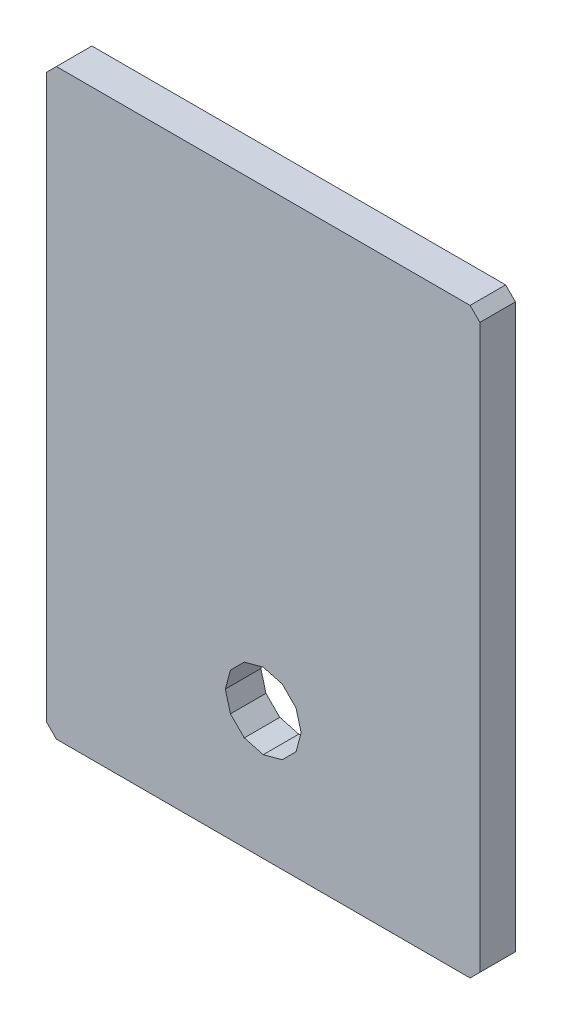
ISO-10303-21;
HEADER;
FILE_DESCRIPTION(('STEP AP214'),'2;1');
FILE_NAME('part.step','',(''),(''),'','','');
FILE_SCHEMA(('AUTOMOTIVE_DESIGN { 1 0 10303 214 1 1 1 1 }'));
ENDSEC;
DATA;
#1=APPLICATION_CONTEXT('core data for automotive mechanical design processes');
#2=APPLICATION_PROTOCOL_DEFINITION('international standard','automotive_design',2000,#1);
#3=PRODUCT_CONTEXT('',#1,'mechanical');
#4=PRODUCT('Part','Part','',(#3));
#5=PRODUCT_RELATED_PRODUCT_CATEGORY('part','',(#4));
#6=PRODUCT_DEFINITION_FORMATION('','',#4);
#7=PRODUCT_DEFINITION_CONTEXT('part definition',#1,'design');
#8=PRODUCT_DEFINITION('design','',#6,#7);
#9=PRODUCT_DEFINITION_SHAPE('','',#8);
#10=(LENGTH_UNIT() NAMED_UNIT(*) SI_UNIT(.MILLI.,.METRE.));
#11=(NAMED_UNIT(*) PLANE_ANGLE_UNIT() SI_UNIT($,.RADIAN.));
#12=(NAMED_UNIT(*) SI_UNIT($,.STERADIAN.) SOLID_ANGLE_UNIT());
#13=UNCERTAINTY_MEASURE_WITH_UNIT(LENGTH_MEASURE(1.E-05),#10,'distance_accuracy_value','');
#14=(GEOMETRIC_REPRESENTATION_CONTEXT(3) GLOBAL_UNCERTAINTY_ASSIGNED_CONTEXT((#13)) GLOBAL_UNIT_ASSIGNED_CONTEXT((#10,
#11,#12)) REPRESENTATION_CONTEXT('',''));
#15=CARTESIAN_POINT('',(0.,0.,0.));
#16=DIRECTION('',(0.,0.,1.));
#17=DIRECTION('',(1.,0.,0.));
#18=AXIS2_PLACEMENT_3D('',#15,#16,#17);
#19=CARTESIAN_POINT('',(0.,0.,1.5));
#20=DIRECTION('',(0.,0.,1.));
#21=DIRECTION('',(1.,0.,0.));
#22=AXIS2_PLACEMENT_3D('',#19,#20,#21);
#23=PLANE('',#22);
#24=DIRECTION('',(-0.70710678118655,-0.707106781186545,0.));
#25=VECTOR('',#24,1.);
#26=CARTESIAN_POINT('',(-9.15,11.8857864376269,1.5));
#27=LINE('',#26,#25);
#28=CARTESIAN_POINT('',(-8.73578643762691,12.3,1.5));
#29=VERTEX_POINT('',#28);
#30=CARTESIAN_POINT('',(-9.15,11.8857864376269,1.5));
#31=VERTEX_POINT('',#30);
#32=EDGE_CURVE('E265',#29,#31,#27,.T.);
#33=ORIENTED_EDGE('',*,*,#32,.T.);
#34=DIRECTION('',(0.,-1.,0.));
#35=VECTOR('',#34,1.);
#36=CARTESIAN_POINT('',(-9.15,11.8857864376269,1.5));
#37=LINE('',#36,#35);
#38=CARTESIAN_POINT('',(-9.15,-11.8857864376269,1.5));
#39=VERTEX_POINT('',#38);
#40=EDGE_CURVE('E268',#31,#39,#37,.T.);
#41=ORIENTED_EDGE('',*,*,#40,.T.);
#42=DIRECTION('',(0.707106781186544,-0.70710678118655,0.));
#43=VECTOR('',#42,1.);
#44=CARTESIAN_POINT('',(-8.73578643762691,-12.3,1.5));
#45=LINE('',#44,#43);
#46=CARTESIAN_POINT('',(-8.73578643762691,-12.3,1.5));
#47=VERTEX_POINT('',#46);
#48=EDGE_CURVE('E271',#39,#47,#45,.T.);
#49=ORIENTED_EDGE('',*,*,#48,.T.);
#50=DIRECTION('',(1.,0.,0.));
#51=VECTOR('',#50,1.);
#52=CARTESIAN_POINT('',(-8.73578643762691,-12.3,1.5));
#53=LINE('',#52,#51);
#54=CARTESIAN_POINT('',(8.7357864376269,-12.3,1.5));
#55=VERTEX_POINT('',#54);
#56=EDGE_CURVE('E273',#47,#55,#53,.T.);
#57=ORIENTED_EDGE('',*,*,#56,.T.);
#58=DIRECTION('',(0.70710678118655,0.707106781186545,0.));
#59=VECTOR('',#58,1.);
#60=CARTESIAN_POINT('',(9.15,-11.8857864376269,1.5));
#61=LINE('',#60,#59);
#62=CARTESIAN_POINT('',(9.15,-11.8857864376269,1.5));
#63=VERTEX_POINT('',#62);
#64=EDGE_CURVE('E275',#55,#63,#61,.T.);
#65=ORIENTED_EDGE('',*,*,#64,.T.);
#66=DIRECTION('',(0.,1.,0.));
#67=VECTOR('',#66,1.);
#68=CARTESIAN_POINT('',(9.15,-11.8857864376269,1.5));
#69=LINE('',#68,#67);
#70=CARTESIAN_POINT('',(9.15,11.8857864376269,1.5));
#71=VERTEX_POINT('',#70);
#72=EDGE_CURVE('E277',#63,#71,#69,.T.);
#73=ORIENTED_EDGE('',*,*,#72,.T.);
#74=DIRECTION('',(-0.707106781186545,0.70710678118655,0.));
#75=VECTOR('',#74,1.);
#76=CARTESIAN_POINT('',(9.15,11.8857864376269,1.5));
#77=LINE('',#76,#75);
#78=CARTESIAN_POINT('',(8.7357864376269,12.3,1.5));
#79=VERTEX_POINT('',#78);
#80=EDGE_CURVE('E279',#71,#79,#77,.T.);
#81=ORIENTED_EDGE('',*,*,#80,.T.);
#82=DIRECTION('',(-1.,0.,0.));
#83=VECTOR('',#82,1.);
#84=CARTESIAN_POINT('',(8.7357864376269,12.3,1.5));
#85=LINE('',#84,#83);
#86=EDGE_CURVE('E281',#79,#29,#85,.T.);
#87=ORIENTED_EDGE('',*,*,#86,.T.);
#88=EDGE_LOOP('',(#33,#41,#49,#57,#65,#73,#81,#87));
#89=FACE_BOUND('',#88,.T.);
#90=DIRECTION('',(0.965925826289065,0.258819045102534,0.));
#91=VECTOR('',#90,1.);
#92=CARTESIAN_POINT('',(0.,-8.50000000000001,1.5));
#93=LINE('',#92,#91);
#94=CARTESIAN_POINT('',(0.,-8.50000000000001,1.5));
#95=VERTEX_POINT('',#94);
#96=CARTESIAN_POINT('',(0.800000000000027,-8.2856406460551,1.5));
#97=VERTEX_POINT('',#96);
#98=EDGE_CURVE('E180',#95,#97,#93,.T.);
#99=ORIENTED_EDGE('',*,*,#98,.F.);
#100=DIRECTION('',(0.965925826289071,-0.25881904510251,0.));
#101=VECTOR('',#100,1.);
#102=CARTESIAN_POINT('',(-0.799999999999997,-8.28564064605512,1.5));
#103=LINE('',#102,#101);
#104=CARTESIAN_POINT('',(-0.799999999999997,-8.28564064605512,1.5));
#105=VERTEX_POINT('',#104);
#106=EDGE_CURVE('E172',#105,#95,#103,.T.);
#107=ORIENTED_EDGE('',*,*,#106,.F.);
#108=DIRECTION('',(0.707106781186557,-0.707106781186538,0.));
#109=VECTOR('',#108,1.);
#110=CARTESIAN_POINT('',(-1.38564064605511,-7.70000000000002,1.5));
#111=LINE('',#110,#109);
#112=CARTESIAN_POINT('',(-1.38564064605511,-7.70000000000002,1.5));
#113=VERTEX_POINT('',#112);
#114=EDGE_CURVE('E213',#113,#105,#111,.T.);
#115=ORIENTED_EDGE('',*,*,#114,.F.);
#116=DIRECTION('',(0.25881904510253,-0.965925826289066,0.));
#117=VECTOR('',#116,1.);
#118=CARTESIAN_POINT('',(-1.60000000000002,-6.90000000000002,1.5));
#119=LINE('',#118,#117);
#120=CARTESIAN_POINT('',(-1.60000000000002,-6.90000000000002,1.5));
#121=VERTEX_POINT('',#120);
#122=EDGE_CURVE('E211',#121,#113,#119,.T.);
#123=ORIENTED_EDGE('',*,*,#122,.F.);
#124=DIRECTION('',(-0.258819045102505,-0.965925826289073,0.));
#125=VECTOR('',#124,1.);
#126=CARTESIAN_POINT('',(-1.38564064605513,-6.1,1.5));
#127=LINE('',#126,#125);
#128=CARTESIAN_POINT('',(-1.38564064605513,-6.1,1.5));
#129=VERTEX_POINT('',#128);
#130=EDGE_CURVE('E209',#129,#121,#127,.T.);
#131=ORIENTED_EDGE('',*,*,#130,.F.);
#132=DIRECTION('',(-0.707106781186539,-0.707106781186556,0.));
#133=VECTOR('',#132,1.);
#134=CARTESIAN_POINT('',(-0.800000000000028,-5.51435935394488,1.5));
#135=LINE('',#134,#133);
#136=CARTESIAN_POINT('',(-0.800000000000028,-5.51435935394488,1.5));
#137=VERTEX_POINT('',#136);
#138=EDGE_CURVE('E207',#137,#129,#135,.T.);
#139=ORIENTED_EDGE('',*,*,#138,.F.);
#140=DIRECTION('',(-0.965925826289066,-0.258819045102531,0.));
#141=VECTOR('',#140,1.);
#142=CARTESIAN_POINT('',(0.,-5.29999999999998,1.5));
#143=LINE('',#142,#141);
#144=CARTESIAN_POINT('',(0.,-5.29999999999998,1.5));
#145=VERTEX_POINT('',#144);
#146=EDGE_CURVE('E205',#145,#137,#143,.T.);
#147=ORIENTED_EDGE('',*,*,#146,.F.);
#148=DIRECTION('',(-0.965925826289072,0.258819045102509,0.));
#149=VECTOR('',#148,1.);
#150=CARTESIAN_POINT('',(0.799999999999991,-5.51435935394487,1.5));
#151=LINE('',#150,#149);
#152=CARTESIAN_POINT('',(0.799999999999991,-5.51435935394487,1.5));
#153=VERTEX_POINT('',#152);
#154=EDGE_CURVE('E203',#153,#145,#151,.T.);
#155=ORIENTED_EDGE('',*,*,#154,.F.);
#156=DIRECTION('',(-0.707106781186557,0.707106781186538,0.));
#157=VECTOR('',#156,1.);
#158=CARTESIAN_POINT('',(1.38564064605511,-6.09999999999997,1.5));
#159=LINE('',#158,#157);
#160=CARTESIAN_POINT('',(1.38564064605511,-6.09999999999997,1.5));
#161=VERTEX_POINT('',#160);
#162=EDGE_CURVE('E201',#161,#153,#159,.T.);
#163=ORIENTED_EDGE('',*,*,#162,.F.);
#164=DIRECTION('',(-0.258819045102533,0.965925826289065,0.));
#165=VECTOR('',#164,1.);
#166=CARTESIAN_POINT('',(1.60000000000002,-6.89999999999997,1.5));
#167=LINE('',#166,#165);
#168=CARTESIAN_POINT('',(1.60000000000002,-6.89999999999997,1.5));
#169=VERTEX_POINT('',#168);
#170=EDGE_CURVE('E199',#169,#161,#167,.T.);
#171=ORIENTED_EDGE('',*,*,#170,.F.);
#172=DIRECTION('',(0.258819045102509,0.965925826289072,0.));
#173=VECTOR('',#172,1.);
#174=CARTESIAN_POINT('',(1.38564064605513,-7.69999999999999,1.5));
#175=LINE('',#174,#173);
#176=CARTESIAN_POINT('',(1.38564064605513,-7.69999999999999,1.5));
#177=VERTEX_POINT('',#176);
#178=EDGE_CURVE('E195',#177,#169,#175,.T.);
#179=ORIENTED_EDGE('',*,*,#178,.F.);
#180=DIRECTION('',(0.707106781186539,0.707106781186556,0.));
#181=VECTOR('',#180,1.);
#182=CARTESIAN_POINT('',(0.800000000000027,-8.2856406460551,1.5));
#183=LINE('',#182,#181);
#184=EDGE_CURVE('E193',#97,#177,#183,.T.);
#185=ORIENTED_EDGE('',*,*,#184,.F.);
#186=EDGE_LOOP('',(#99,#107,#115,#123,#131,#139,#147,#155,#163,#171,#179,#185));
#187=FACE_BOUND('',#186,.T.);
#188=ADVANCED_FACE('F35',(#89,#187),#23,.T.);
#189=CARTESIAN_POINT('',(0.,0.,0.));
#190=DIRECTION('',(0.,0.,1.));
#191=DIRECTION('',(1.,0.,0.));
#192=AXIS2_PLACEMENT_3D('',#189,#190,#191);
#193=PLANE('',#192);
#194=DIRECTION('',(-0.70710678118655,-0.707106781186545,0.));
#195=VECTOR('',#194,1.);
#196=CARTESIAN_POINT('',(-9.15,11.8857864376269,0.));
#197=LINE('',#196,#195);
#198=CARTESIAN_POINT('',(-8.73578643762691,12.3,0.));
#199=VERTEX_POINT('',#198);
#200=CARTESIAN_POINT('',(-9.15,11.8857864376269,0.));
#201=VERTEX_POINT('',#200);
#202=EDGE_CURVE('E188',#199,#201,#197,.T.);
#203=ORIENTED_EDGE('',*,*,#202,.F.);
#204=DIRECTION('',(-1.,0.,0.));
#205=VECTOR('',#204,1.);
#206=CARTESIAN_POINT('',(8.7357864376269,12.3,0.));
#207=LINE('',#206,#205);
#208=CARTESIAN_POINT('',(8.7357864376269,12.3,0.));
#209=VERTEX_POINT('',#208);
#210=EDGE_CURVE('E269',#209,#199,#207,.T.);
#211=ORIENTED_EDGE('',*,*,#210,.F.);
#212=DIRECTION('',(-0.707106781186545,0.70710678118655,0.));
#213=VECTOR('',#212,1.);
#214=CARTESIAN_POINT('',(9.15,11.8857864376269,0.));
#215=LINE('',#214,#213);
#216=CARTESIAN_POINT('',(9.15,11.8857864376269,0.));
#217=VERTEX_POINT('',#216);
#218=EDGE_CURVE('E296',#217,#209,#215,.T.);
#219=ORIENTED_EDGE('',*,*,#218,.F.);
#220=DIRECTION('',(0.,1.,0.));
#221=VECTOR('',#220,1.);
#222=CARTESIAN_POINT('',(9.15,-11.8857864376269,0.));
#223=LINE('',#222,#221);
#224=CARTESIAN_POINT('',(9.15,-11.8857864376269,0.));
#225=VERTEX_POINT('',#224);
#226=EDGE_CURVE('E294',#225,#217,#223,.T.);
#227=ORIENTED_EDGE('',*,*,#226,.F.);
#228=DIRECTION('',(0.70710678118655,0.707106781186545,0.));
#229=VECTOR('',#228,1.);
#230=CARTESIAN_POINT('',(9.15,-11.8857864376269,0.));
#231=LINE('',#230,#229);
#232=CARTESIAN_POINT('',(8.7357864376269,-12.3,0.));
#233=VERTEX_POINT('',#232);
#234=EDGE_CURVE('E292',#233,#225,#231,.T.);
#235=ORIENTED_EDGE('',*,*,#234,.F.);
#236=DIRECTION('',(1.,0.,0.));
#237=VECTOR('',#236,1.);
#238=CARTESIAN_POINT('',(-8.73578643762691,-12.3,0.));
#239=LINE('',#238,#237);
#240=CARTESIAN_POINT('',(-8.73578643762691,-12.3,0.));
#241=VERTEX_POINT('',#240);
#242=EDGE_CURVE('E290',#241,#233,#239,.T.);
#243=ORIENTED_EDGE('',*,*,#242,.F.);
#244=DIRECTION('',(0.707106781186544,-0.70710678118655,0.));
#245=VECTOR('',#244,1.);
#246=CARTESIAN_POINT('',(-8.73578643762691,-12.3,0.));
#247=LINE('',#246,#245);
#248=CARTESIAN_POINT('',(-9.15,-11.8857864376269,0.));
#249=VERTEX_POINT('',#248);
#250=EDGE_CURVE('E288',#249,#241,#247,.T.);
#251=ORIENTED_EDGE('',*,*,#250,.F.);
#252=DIRECTION('',(0.,-1.,0.));
#253=VECTOR('',#252,1.);
#254=CARTESIAN_POINT('',(-9.15,11.8857864376269,0.));
#255=LINE('',#254,#253);
#256=EDGE_CURVE('E286',#201,#249,#255,.T.);
#257=ORIENTED_EDGE('',*,*,#256,.F.);
#258=EDGE_LOOP('',(#203,#211,#219,#227,#235,#243,#251,#257));
#259=FACE_BOUND('',#258,.T.);
#260=DIRECTION('',(0.965925826289071,-0.25881904510251,0.));
#261=VECTOR('',#260,1.);
#262=CARTESIAN_POINT('',(-0.799999999999997,-8.28564064605512,0.));
#263=LINE('',#262,#261);
#264=CARTESIAN_POINT('',(-0.799999999999997,-8.28564064605512,0.));
#265=VERTEX_POINT('',#264);
#266=CARTESIAN_POINT('',(0.,-8.50000000000001,0.));
#267=VERTEX_POINT('',#266);
#268=EDGE_CURVE('E58',#265,#267,#263,.T.);
#269=ORIENTED_EDGE('',*,*,#268,.T.);
#270=DIRECTION('',(0.965925826289065,0.258819045102534,0.));
#271=VECTOR('',#270,1.);
#272=CARTESIAN_POINT('',(0.,-8.50000000000001,0.));
#273=LINE('',#272,#271);
#274=CARTESIAN_POINT('',(0.800000000000027,-8.2856406460551,0.));
#275=VERTEX_POINT('',#274);
#276=EDGE_CURVE('E187',#267,#275,#273,.T.);
#277=ORIENTED_EDGE('',*,*,#276,.T.);
#278=DIRECTION('',(0.707106781186539,0.707106781186556,0.));
#279=VECTOR('',#278,1.);
#280=CARTESIAN_POINT('',(0.800000000000027,-8.2856406460551,0.));
#281=LINE('',#280,#279);
#282=CARTESIAN_POINT('',(1.38564064605513,-7.69999999999999,0.));
#283=VERTEX_POINT('',#282);
#284=EDGE_CURVE('E217',#275,#283,#281,.T.);
#285=ORIENTED_EDGE('',*,*,#284,.T.);
#286=DIRECTION('',(0.258819045102509,0.965925826289072,0.));
#287=VECTOR('',#286,1.);
#288=CARTESIAN_POINT('',(1.38564064605513,-7.69999999999999,0.));
#289=LINE('',#288,#287);
#290=CARTESIAN_POINT('',(1.60000000000002,-6.89999999999997,0.));
#291=VERTEX_POINT('',#290);
#292=EDGE_CURVE('E220',#283,#291,#289,.T.);
#293=ORIENTED_EDGE('',*,*,#292,.T.);
#294=DIRECTION('',(-0.258819045102533,0.965925826289065,0.));
#295=VECTOR('',#294,1.);
#296=CARTESIAN_POINT('',(1.60000000000002,-6.89999999999997,0.));
#297=LINE('',#296,#295);
#298=CARTESIAN_POINT('',(1.38564064605511,-6.09999999999997,0.));
#299=VERTEX_POINT('',#298);
#300=EDGE_CURVE('E223',#291,#299,#297,.T.);
#301=ORIENTED_EDGE('',*,*,#300,.T.);
#302=DIRECTION('',(-0.707106781186557,0.707106781186538,0.));
#303=VECTOR('',#302,1.);
#304=CARTESIAN_POINT('',(1.38564064605511,-6.09999999999997,0.));
#305=LINE('',#304,#303);
#306=CARTESIAN_POINT('',(0.799999999999991,-5.51435935394487,0.));
#307=VERTEX_POINT('',#306);
#308=EDGE_CURVE('E226',#299,#307,#305,.T.);
#309=ORIENTED_EDGE('',*,*,#308,.T.);
#310=DIRECTION('',(-0.965925826289072,0.258819045102509,0.));
#311=VECTOR('',#310,1.);
#312=CARTESIAN_POINT('',(0.799999999999991,-5.51435935394487,0.));
#313=LINE('',#312,#311);
#314=CARTESIAN_POINT('',(0.,-5.29999999999998,0.));
#315=VERTEX_POINT('',#314);
#316=EDGE_CURVE('E229',#307,#315,#313,.T.);
#317=ORIENTED_EDGE('',*,*,#316,.T.);
#318=DIRECTION('',(-0.965925826289066,-0.258819045102531,0.));
#319=VECTOR('',#318,1.);
#320=CARTESIAN_POINT('',(0.,-5.29999999999998,0.));
#321=LINE('',#320,#319);
#322=CARTESIAN_POINT('',(-0.800000000000028,-5.51435935394488,0.));
#323=VERTEX_POINT('',#322);
#324=EDGE_CURVE('E232',#315,#323,#321,.T.);
#325=ORIENTED_EDGE('',*,*,#324,.T.);
#326=DIRECTION('',(-0.707106781186539,-0.707106781186556,0.));
#327=VECTOR('',#326,1.);
#328=CARTESIAN_POINT('',(-0.800000000000028,-5.51435935394488,0.));
#329=LINE('',#328,#327);
#330=CARTESIAN_POINT('',(-1.38564064605513,-6.1,0.));
#331=VERTEX_POINT('',#330);
#332=EDGE_CURVE('E235',#323,#331,#329,.T.);
#333=ORIENTED_EDGE('',*,*,#332,.T.);
#334=DIRECTION('',(-0.258819045102505,-0.965925826289073,0.));
#335=VECTOR('',#334,1.);
#336=CARTESIAN_POINT('',(-1.38564064605513,-6.1,0.));
#337=LINE('',#336,#335);
#338=CARTESIAN_POINT('',(-1.60000000000002,-6.90000000000002,0.));
#339=VERTEX_POINT('',#338);
#340=EDGE_CURVE('E238',#331,#339,#337,.T.);
#341=ORIENTED_EDGE('',*,*,#340,.T.);
#342=DIRECTION('',(0.25881904510253,-0.965925826289066,0.));
#343=VECTOR('',#342,1.);
#344=CARTESIAN_POINT('',(-1.60000000000002,-6.90000000000002,0.));
#345=LINE('',#344,#343);
#346=CARTESIAN_POINT('',(-1.38564064605511,-7.70000000000002,0.));
#347=VERTEX_POINT('',#346);
#348=EDGE_CURVE('E241',#339,#347,#345,.T.);
#349=ORIENTED_EDGE('',*,*,#348,.T.);
#350=DIRECTION('',(0.707106781186557,-0.707106781186538,0.));
#351=VECTOR('',#350,1.);
#352=CARTESIAN_POINT('',(-1.38564064605511,-7.70000000000002,0.));
#353=LINE('',#352,#351);
#354=EDGE_CURVE('E181',#347,#265,#353,.T.);
#355=ORIENTED_EDGE('',*,*,#354,.T.);
#356=EDGE_LOOP('',(#269,#277,#285,#293,#301,#309,#317,#325,#333,#341,#349,#355));
#357=FACE_BOUND('',#356,.T.);
#358=ADVANCED_FACE('F326',(#259,#357),#193,.F.);
#359=CARTESIAN_POINT('',(-9.15,11.8857864376269,1.5));
#360=DIRECTION('',(0.707106781186544,-0.70710678118655,0.));
#361=DIRECTION('',(0.70710678118655,0.707106781186545,0.));
#362=AXIS2_PLACEMENT_3D('',#359,#360,#361);
#363=PLANE('',#362);
#364=ORIENTED_EDGE('',*,*,#202,.T.);
#365=DIRECTION('',(0.,0.,-1.));
#366=VECTOR('',#365,1.);
#367=CARTESIAN_POINT('',(-9.15,11.8857864376269,1.5));
#368=LINE('',#367,#366);
#369=EDGE_CURVE('E11',#31,#201,#368,.T.);
#370=ORIENTED_EDGE('',*,*,#369,.F.);
#371=ORIENTED_EDGE('',*,*,#32,.F.);
#372=DIRECTION('',(0.,0.,-1.));
#373=VECTOR('',#372,1.);
#374=CARTESIAN_POINT('',(-8.73578643762691,12.3,1.5));
#375=LINE('',#374,#373);
#376=EDGE_CURVE('E283',#29,#199,#375,.T.);
#377=ORIENTED_EDGE('',*,*,#376,.T.);
#378=EDGE_LOOP('',(#364,#370,#371,#377));
#379=FACE_BOUND('',#378,.T.);
#380=ADVANCED_FACE('F37',(#379),#363,.F.);
#381=CARTESIAN_POINT('',(-9.15,11.8857864376269,1.5));
#382=DIRECTION('',(1.,0.,0.));
#383=DIRECTION('',(0.,0.,-1.));
#384=AXIS2_PLACEMENT_3D('',#381,#382,#383);
#385=PLANE('',#384);
#386=ORIENTED_EDGE('',*,*,#256,.T.);
#387=DIRECTION('',(0.,0.,-1.));
#388=VECTOR('',#387,1.);
#389=CARTESIAN_POINT('',(-9.15,-11.8857864376269,1.5));
#390=LINE('',#389,#388);
#391=EDGE_CURVE('E43',#39,#249,#390,.T.);
#392=ORIENTED_EDGE('',*,*,#391,.F.);
#393=ORIENTED_EDGE('',*,*,#40,.F.);
#394=ORIENTED_EDGE('',*,*,#369,.T.);
#395=EDGE_LOOP('',(#386,#392,#393,#394));
#396=FACE_BOUND('',#395,.T.);
#397=ADVANCED_FACE('F343',(#396),#385,.F.);
#398=CARTESIAN_POINT('',(-8.73578643762691,-12.3,1.5));
#399=DIRECTION('',(0.707106781186551,0.707106781186545,0.));
#400=DIRECTION('',(-0.707106781186545,0.707106781186551,0.));
#401=AXIS2_PLACEMENT_3D('',#398,#399,#400);
#402=PLANE('',#401);
#403=ORIENTED_EDGE('',*,*,#250,.T.);
#404=DIRECTION('',(0.,0.,-1.));
#405=VECTOR('',#404,1.);
#406=CARTESIAN_POINT('',(-8.73578643762691,-12.3,1.5));
#407=LINE('',#406,#405);
#408=EDGE_CURVE('E313',#47,#241,#407,.T.);
#409=ORIENTED_EDGE('',*,*,#408,.F.);
#410=ORIENTED_EDGE('',*,*,#48,.F.);
#411=ORIENTED_EDGE('',*,*,#391,.T.);
#412=EDGE_LOOP('',(#403,#409,#410,#411));
#413=FACE_BOUND('',#412,.T.);
#414=ADVANCED_FACE('F320',(#413),#402,.F.);
#415=CARTESIAN_POINT('',(-8.73578643762691,-12.3,1.5));
#416=DIRECTION('',(0.,1.,0.));
#417=DIRECTION('',(0.,0.,1.));
#418=AXIS2_PLACEMENT_3D('',#415,#416,#417);
#419=PLANE('',#418);
#420=ORIENTED_EDGE('',*,*,#242,.T.);
#421=DIRECTION('',(0.,0.,-1.));
#422=VECTOR('',#421,1.);
#423=CARTESIAN_POINT('',(8.7357864376269,-12.3,1.5));
#424=LINE('',#423,#422);
#425=EDGE_CURVE('E310',#55,#233,#424,.T.);
#426=ORIENTED_EDGE('',*,*,#425,.F.);
#427=ORIENTED_EDGE('',*,*,#56,.F.);
#428=ORIENTED_EDGE('',*,*,#408,.T.);
#429=EDGE_LOOP('',(#420,#426,#427,#428));
#430=FACE_BOUND('',#429,.T.);
#431=ADVANCED_FACE('F332',(#430),#419,.F.);
#432=CARTESIAN_POINT('',(9.15,-11.8857864376269,1.5));
#433=DIRECTION('',(-0.707106781186544,0.70710678118655,0.));
#434=DIRECTION('',(-0.70710678118655,-0.707106781186545,0.));
#435=AXIS2_PLACEMENT_3D('',#432,#433,#434);
#436=PLANE('',#435);
#437=ORIENTED_EDGE('',*,*,#234,.T.);
#438=DIRECTION('',(0.,0.,-1.));
#439=VECTOR('',#438,1.);
#440=CARTESIAN_POINT('',(9.15,-11.8857864376269,1.5));
#441=LINE('',#440,#439);
#442=EDGE_CURVE('E307',#63,#225,#441,.T.);
#443=ORIENTED_EDGE('',*,*,#442,.F.);
#444=ORIENTED_EDGE('',*,*,#64,.F.);
#445=ORIENTED_EDGE('',*,*,#425,.T.);
#446=EDGE_LOOP('',(#437,#443,#444,#445));
#447=FACE_BOUND('',#446,.T.);
#448=ADVANCED_FACE('F336',(#447),#436,.F.);
#449=CARTESIAN_POINT('',(9.15,-11.8857864376269,1.5));
#450=DIRECTION('',(-1.,0.,0.));
#451=DIRECTION('',(0.,0.,1.));
#452=AXIS2_PLACEMENT_3D('',#449,#450,#451);
#453=PLANE('',#452);
#454=ORIENTED_EDGE('',*,*,#226,.T.);
#455=DIRECTION('',(0.,0.,-1.));
#456=VECTOR('',#455,1.);
#457=CARTESIAN_POINT('',(9.15,11.8857864376269,1.5));
#458=LINE('',#457,#456);
#459=EDGE_CURVE('E304',#71,#217,#458,.T.);
#460=ORIENTED_EDGE('',*,*,#459,.F.);
#461=ORIENTED_EDGE('',*,*,#72,.F.);
#462=ORIENTED_EDGE('',*,*,#442,.T.);
#463=EDGE_LOOP('',(#454,#460,#461,#462));
#464=FACE_BOUND('',#463,.T.);
#465=ADVANCED_FACE('F356',(#464),#453,.F.);
#466=CARTESIAN_POINT('',(9.15,11.8857864376269,1.5));
#467=DIRECTION('',(-0.70710678118655,-0.707106781186544,0.));
#468=DIRECTION('',(0.707106781186545,-0.70710678118655,0.));
#469=AXIS2_PLACEMENT_3D('',#466,#467,#468);
#470=PLANE('',#469);
#471=ORIENTED_EDGE('',*,*,#218,.T.);
#472=DIRECTION('',(0.,0.,-1.));
#473=VECTOR('',#472,1.);
#474=CARTESIAN_POINT('',(8.7357864376269,12.3,1.5));
#475=LINE('',#474,#473);
#476=EDGE_CURVE('E301',#79,#209,#475,.T.);
#477=ORIENTED_EDGE('',*,*,#476,.F.);
#478=ORIENTED_EDGE('',*,*,#80,.F.);
#479=ORIENTED_EDGE('',*,*,#459,.T.);
#480=EDGE_LOOP('',(#471,#477,#478,#479));
#481=FACE_BOUND('',#480,.T.);
#482=ADVANCED_FACE('F354',(#481),#470,.F.);
#483=CARTESIAN_POINT('',(8.7357864376269,12.3,1.5));
#484=DIRECTION('',(0.,-1.,0.));
#485=DIRECTION('',(0.,0.,-1.));
#486=AXIS2_PLACEMENT_3D('',#483,#484,#485);
#487=PLANE('',#486);
#488=ORIENTED_EDGE('',*,*,#210,.T.);
#489=ORIENTED_EDGE('',*,*,#376,.F.);
#490=ORIENTED_EDGE('',*,*,#86,.F.);
#491=ORIENTED_EDGE('',*,*,#476,.T.);
#492=EDGE_LOOP('',(#488,#489,#490,#491));
#493=FACE_BOUND('',#492,.T.);
#494=ADVANCED_FACE('F349',(#493),#487,.F.);
#495=CARTESIAN_POINT('',(-0.799999999999997,-8.28564064605512,1.5));
#496=DIRECTION('',(0.25881904510251,0.965925826289071,0.));
#497=DIRECTION('',(-0.965925826289071,0.25881904510251,0.));
#498=AXIS2_PLACEMENT_3D('',#495,#496,#497);
#499=PLANE('',#498);
#500=ORIENTED_EDGE('',*,*,#268,.F.);
#501=DIRECTION('',(0.,0.,-1.));
#502=VECTOR('',#501,1.);
#503=CARTESIAN_POINT('',(-0.799999999999997,-8.28564064605512,1.5));
#504=LINE('',#503,#502);
#505=EDGE_CURVE('E176',#105,#265,#504,.T.);
#506=ORIENTED_EDGE('',*,*,#505,.F.);
#507=ORIENTED_EDGE('',*,*,#106,.T.);
#508=DIRECTION('',(0.,0.,-1.));
#509=VECTOR('',#508,1.);
#510=CARTESIAN_POINT('',(0.,-8.50000000000001,1.5));
#511=LINE('',#510,#509);
#512=EDGE_CURVE('E175',#95,#267,#511,.T.);
#513=ORIENTED_EDGE('',*,*,#512,.T.);
#514=EDGE_LOOP('',(#500,#506,#507,#513));
#515=FACE_BOUND('',#514,.T.);
#516=ADVANCED_FACE('F174',(#515),#499,.T.);
#517=CARTESIAN_POINT('',(0.,-8.50000000000001,1.5));
#518=DIRECTION('',(-0.258819045102535,0.965925826289065,0.));
#519=DIRECTION('',(-0.965925826289065,-0.258819045102535,0.));
#520=AXIS2_PLACEMENT_3D('',#517,#518,#519);
#521=PLANE('',#520);
#522=ORIENTED_EDGE('',*,*,#276,.F.);
#523=ORIENTED_EDGE('',*,*,#512,.F.);
#524=ORIENTED_EDGE('',*,*,#98,.T.);
#525=DIRECTION('',(0.,0.,-1.));
#526=VECTOR('',#525,1.);
#527=CARTESIAN_POINT('',(0.800000000000027,-8.2856406460551,1.5));
#528=LINE('',#527,#526);
#529=EDGE_CURVE('E189',#97,#275,#528,.T.);
#530=ORIENTED_EDGE('',*,*,#529,.T.);
#531=EDGE_LOOP('',(#522,#523,#524,#530));
#532=FACE_BOUND('',#531,.T.);
#533=ADVANCED_FACE('F184',(#532),#521,.T.);
#534=CARTESIAN_POINT('',(0.800000000000027,-8.2856406460551,1.5));
#535=DIRECTION('',(-0.707106781186556,0.707106781186539,0.));
#536=DIRECTION('',(-0.707106781186539,-0.707106781186556,0.));
#537=AXIS2_PLACEMENT_3D('',#534,#535,#536);
#538=PLANE('',#537);
#539=ORIENTED_EDGE('',*,*,#284,.F.);
#540=ORIENTED_EDGE('',*,*,#529,.F.);
#541=ORIENTED_EDGE('',*,*,#184,.T.);
#542=DIRECTION('',(0.,0.,-1.));
#543=VECTOR('',#542,1.);
#544=CARTESIAN_POINT('',(1.38564064605513,-7.69999999999999,1.5));
#545=LINE('',#544,#543);
#546=EDGE_CURVE('E262',#177,#283,#545,.T.);
#547=ORIENTED_EDGE('',*,*,#546,.T.);
#548=EDGE_LOOP('',(#539,#540,#541,#547));
#549=FACE_BOUND('',#548,.T.);
#550=ADVANCED_FACE('F381',(#549),#538,.T.);
#551=CARTESIAN_POINT('',(1.38564064605513,-7.69999999999999,1.5));
#552=DIRECTION('',(-0.965925826289071,0.258819045102509,0.));
#553=DIRECTION('',(-0.258819045102509,-0.965925826289072,0.));
#554=AXIS2_PLACEMENT_3D('',#551,#552,#553);
#555=PLANE('',#554);
#556=ORIENTED_EDGE('',*,*,#292,.F.);
#557=ORIENTED_EDGE('',*,*,#546,.F.);
#558=ORIENTED_EDGE('',*,*,#178,.T.);
#559=DIRECTION('',(0.,0.,-1.));
#560=VECTOR('',#559,1.);
#561=CARTESIAN_POINT('',(1.60000000000002,-6.89999999999997,1.5));
#562=LINE('',#561,#560);
#563=EDGE_CURVE('E260',#169,#291,#562,.T.);
#564=ORIENTED_EDGE('',*,*,#563,.T.);
#565=EDGE_LOOP('',(#556,#557,#558,#564));
#566=FACE_BOUND('',#565,.T.);
#567=ADVANCED_FACE('F385',(#566),#555,.T.);
#568=CARTESIAN_POINT('',(1.60000000000002,-6.89999999999997,1.5));
#569=DIRECTION('',(-0.965925826289065,-0.258819045102533,0.));
#570=DIRECTION('',(0.258819045102533,-0.965925826289065,0.));
#571=AXIS2_PLACEMENT_3D('',#568,#569,#570);
#572=PLANE('',#571);
#573=ORIENTED_EDGE('',*,*,#300,.F.);
#574=ORIENTED_EDGE('',*,*,#563,.F.);
#575=ORIENTED_EDGE('',*,*,#170,.T.);
#576=DIRECTION('',(0.,0.,-1.));
#577=VECTOR('',#576,1.);
#578=CARTESIAN_POINT('',(1.38564064605511,-6.09999999999997,1.5));
#579=LINE('',#578,#577);
#580=EDGE_CURVE('E258',#161,#299,#579,.T.);
#581=ORIENTED_EDGE('',*,*,#580,.T.);
#582=EDGE_LOOP('',(#573,#574,#575,#581));
#583=FACE_BOUND('',#582,.T.);
#584=ADVANCED_FACE('F391',(#583),#572,.T.);
#585=CARTESIAN_POINT('',(1.38564064605511,-6.09999999999997,1.5));
#586=DIRECTION('',(-0.707106781186538,-0.707106781186557,0.));
#587=DIRECTION('',(0.707106781186557,-0.707106781186538,0.));
#588=AXIS2_PLACEMENT_3D('',#585,#586,#587);
#589=PLANE('',#588);
#590=ORIENTED_EDGE('',*,*,#308,.F.);
#591=ORIENTED_EDGE('',*,*,#580,.F.);
#592=ORIENTED_EDGE('',*,*,#162,.T.);
#593=DIRECTION('',(0.,0.,-1.));
#594=VECTOR('',#593,1.);
#595=CARTESIAN_POINT('',(0.799999999999991,-5.51435935394487,1.5));
#596=LINE('',#595,#594);
#597=EDGE_CURVE('E256',#153,#307,#596,.T.);
#598=ORIENTED_EDGE('',*,*,#597,.T.);
#599=EDGE_LOOP('',(#590,#591,#592,#598));
#600=FACE_BOUND('',#599,.T.);
#601=ADVANCED_FACE('F395',(#600),#589,.T.);
#602=CARTESIAN_POINT('',(0.799999999999991,-5.51435935394487,1.5));
#603=DIRECTION('',(-0.258819045102508,-0.965925826289071,0.));
#604=DIRECTION('',(0.965925826289072,-0.258819045102509,0.));
#605=AXIS2_PLACEMENT_3D('',#602,#603,#604);
#606=PLANE('',#605);
#607=ORIENTED_EDGE('',*,*,#316,.F.);
#608=ORIENTED_EDGE('',*,*,#597,.F.);
#609=ORIENTED_EDGE('',*,*,#154,.T.);
#610=DIRECTION('',(0.,0.,-1.));
#611=VECTOR('',#610,1.);
#612=CARTESIAN_POINT('',(0.,-5.29999999999998,1.5));
#613=LINE('',#612,#611);
#614=EDGE_CURVE('E254',#145,#315,#613,.T.);
#615=ORIENTED_EDGE('',*,*,#614,.T.);
#616=EDGE_LOOP('',(#607,#608,#609,#615));
#617=FACE_BOUND('',#616,.T.);
#618=ADVANCED_FACE('F399',(#617),#606,.T.);
#619=CARTESIAN_POINT('',(0.,-5.29999999999998,1.5));
#620=DIRECTION('',(0.258819045102531,-0.965925826289065,0.));
#621=DIRECTION('',(0.965925826289066,0.258819045102531,0.));
#622=AXIS2_PLACEMENT_3D('',#619,#620,#621);
#623=PLANE('',#622);
#624=ORIENTED_EDGE('',*,*,#324,.F.);
#625=ORIENTED_EDGE('',*,*,#614,.F.);
#626=ORIENTED_EDGE('',*,*,#146,.T.);
#627=DIRECTION('',(0.,0.,-1.));
#628=VECTOR('',#627,1.);
#629=CARTESIAN_POINT('',(-0.800000000000028,-5.51435935394488,1.5));
#630=LINE('',#629,#628);
#631=EDGE_CURVE('E252',#137,#323,#630,.T.);
#632=ORIENTED_EDGE('',*,*,#631,.T.);
#633=EDGE_LOOP('',(#624,#625,#626,#632));
#634=FACE_BOUND('',#633,.T.);
#635=ADVANCED_FACE('F403',(#634),#623,.T.);
#636=CARTESIAN_POINT('',(-0.800000000000028,-5.51435935394488,1.5));
#637=DIRECTION('',(0.707106781186556,-0.707106781186539,0.));
#638=DIRECTION('',(0.707106781186539,0.707106781186556,0.));
#639=AXIS2_PLACEMENT_3D('',#636,#637,#638);
#640=PLANE('',#639);
#641=ORIENTED_EDGE('',*,*,#332,.F.);
#642=ORIENTED_EDGE('',*,*,#631,.F.);
#643=ORIENTED_EDGE('',*,*,#138,.T.);
#644=DIRECTION('',(0.,0.,-1.));
#645=VECTOR('',#644,1.);
#646=CARTESIAN_POINT('',(-1.38564064605513,-6.1,1.5));
#647=LINE('',#646,#645);
#648=EDGE_CURVE('E250',#129,#331,#647,.T.);
#649=ORIENTED_EDGE('',*,*,#648,.T.);
#650=EDGE_LOOP('',(#641,#642,#643,#649));
#651=FACE_BOUND('',#650,.T.);
#652=ADVANCED_FACE('F407',(#651),#640,.T.);
#653=CARTESIAN_POINT('',(-1.38564064605513,-6.1,1.5));
#654=DIRECTION('',(0.965925826289072,-0.258819045102505,0.));
#655=DIRECTION('',(0.258819045102505,0.965925826289072,0.));
#656=AXIS2_PLACEMENT_3D('',#653,#654,#655);
#657=PLANE('',#656);
#658=ORIENTED_EDGE('',*,*,#340,.F.);
#659=ORIENTED_EDGE('',*,*,#648,.F.);
#660=ORIENTED_EDGE('',*,*,#130,.T.);
#661=DIRECTION('',(0.,0.,-1.));
#662=VECTOR('',#661,1.);
#663=CARTESIAN_POINT('',(-1.60000000000002,-6.90000000000002,1.5));
#664=LINE('',#663,#662);
#665=EDGE_CURVE('E248',#121,#339,#664,.T.);
#666=ORIENTED_EDGE('',*,*,#665,.T.);
#667=EDGE_LOOP('',(#658,#659,#660,#666));
#668=FACE_BOUND('',#667,.T.);
#669=ADVANCED_FACE('F411',(#668),#657,.T.);
#670=CARTESIAN_POINT('',(-1.60000000000002,-6.90000000000002,1.5));
#671=DIRECTION('',(0.965925826289066,0.25881904510253,0.));
#672=DIRECTION('',(-0.25881904510253,0.965925826289066,0.));
#673=AXIS2_PLACEMENT_3D('',#670,#671,#672);
#674=PLANE('',#673);
#675=ORIENTED_EDGE('',*,*,#348,.F.);
#676=ORIENTED_EDGE('',*,*,#665,.F.);
#677=ORIENTED_EDGE('',*,*,#122,.T.);
#678=DIRECTION('',(0.,0.,-1.));
#679=VECTOR('',#678,1.);
#680=CARTESIAN_POINT('',(-1.38564064605511,-7.70000000000002,1.5));
#681=LINE('',#680,#679);
#682=EDGE_CURVE('E50',#113,#347,#681,.T.);
#683=ORIENTED_EDGE('',*,*,#682,.T.);
#684=EDGE_LOOP('',(#675,#676,#677,#683));
#685=FACE_BOUND('',#684,.T.);
#686=ADVANCED_FACE('F415',(#685),#674,.T.);
#687=CARTESIAN_POINT('',(-1.38564064605511,-7.70000000000002,1.5));
#688=DIRECTION('',(0.707106781186538,0.707106781186557,0.));
#689=DIRECTION('',(-0.707106781186557,0.707106781186538,0.));
#690=AXIS2_PLACEMENT_3D('',#687,#688,#689);
#691=PLANE('',#690);
#692=ORIENTED_EDGE('',*,*,#354,.F.);
#693=ORIENTED_EDGE('',*,*,#682,.F.);
#694=ORIENTED_EDGE('',*,*,#114,.T.);
#695=ORIENTED_EDGE('',*,*,#505,.T.);
#696=EDGE_LOOP('',(#692,#693,#694,#695));
#697=FACE_BOUND('',#696,.T.);
#698=ADVANCED_FACE('F419',(#697),#691,.T.);
#699=CLOSED_SHELL('',(#188,#358,#380,#397,#414,#431,#448,#465,#482,#494,#516,#533,#550,#567,
#584,#601,#618,#635,#652,#669,#686,#698));
#700=MANIFOLD_SOLID_BREP('B2',#699);
#701=ADVANCED_BREP_SHAPE_REPRESENTATION('',(#18,#700),#14);
#702=SHAPE_DEFINITION_REPRESENTATION(#9,#701);
ENDSEC;
END-ISO-10303-21;
